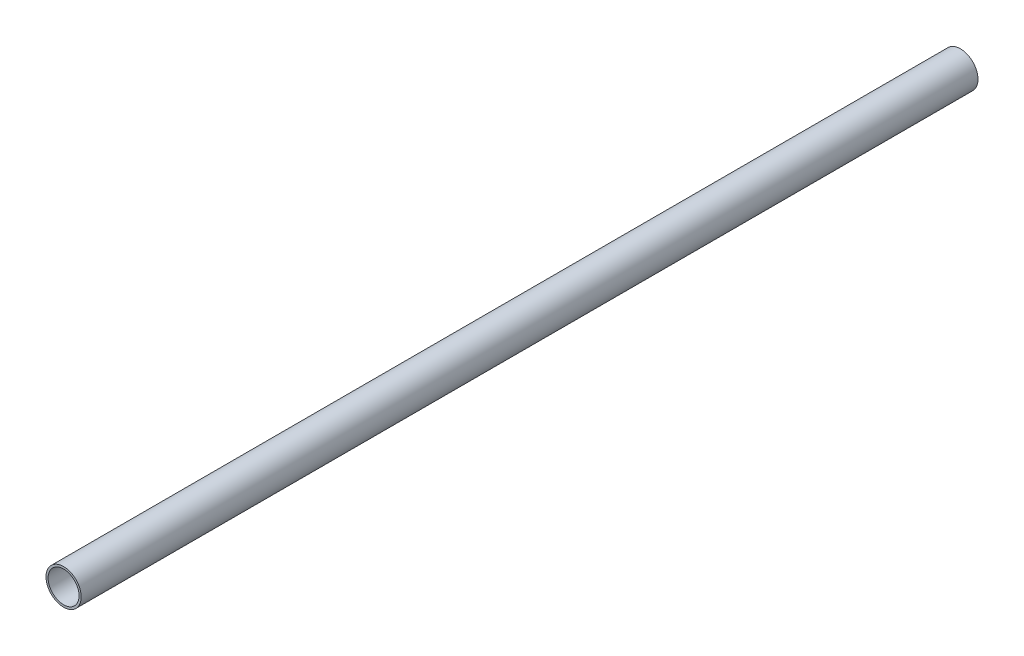
ISO-10303-21;
HEADER;
FILE_DESCRIPTION(('STEP AP214'),'2;1');
FILE_NAME('part.step','',(''),(''),'','','');
FILE_SCHEMA(('AUTOMOTIVE_DESIGN { 1 0 10303 214 1 1 1 1 }'));
ENDSEC;
DATA;
#1=APPLICATION_CONTEXT('core data for automotive mechanical design processes');
#2=APPLICATION_PROTOCOL_DEFINITION('international standard','automotive_design',2000,#1);
#3=PRODUCT_CONTEXT('',#1,'mechanical');
#4=PRODUCT('Part','Part','',(#3));
#5=PRODUCT_RELATED_PRODUCT_CATEGORY('part','',(#4));
#6=PRODUCT_DEFINITION_FORMATION('','',#4);
#7=PRODUCT_DEFINITION_CONTEXT('part definition',#1,'design');
#8=PRODUCT_DEFINITION('design','',#6,#7);
#9=PRODUCT_DEFINITION_SHAPE('','',#8);
#10=(LENGTH_UNIT() NAMED_UNIT(*) SI_UNIT(.MILLI.,.METRE.));
#11=(NAMED_UNIT(*) PLANE_ANGLE_UNIT() SI_UNIT($,.RADIAN.));
#12=(NAMED_UNIT(*) SI_UNIT($,.STERADIAN.) SOLID_ANGLE_UNIT());
#13=UNCERTAINTY_MEASURE_WITH_UNIT(LENGTH_MEASURE(1.E-05),#10,'distance_accuracy_value','');
#14=(GEOMETRIC_REPRESENTATION_CONTEXT(3) GLOBAL_UNCERTAINTY_ASSIGNED_CONTEXT((#13)) GLOBAL_UNIT_ASSIGNED_CONTEXT((#10,
#11,#12)) REPRESENTATION_CONTEXT('',''));
#15=CARTESIAN_POINT('',(0.,0.,0.));
#16=DIRECTION('',(0.,0.,1.));
#17=DIRECTION('',(1.,0.,0.));
#18=AXIS2_PLACEMENT_3D('',#15,#16,#17);
#19=CARTESIAN_POINT('',(4.21884749357559E-12,691.00000000001,-900.000000000006));
#20=DIRECTION('',(0.,0.,-1.));
#21=DIRECTION('',(0.,1.00000000000001,0.));
#22=AXIS2_PLACEMENT_3D('',#19,#20,#21);
#23=CYLINDRICAL_SURFACE('',#22,12.5);
#24=CARTESIAN_POINT('',(7.99360577730113E-12,691.000000000009,-1557.));
#25=DIRECTION('',(0.,0.,-1.));
#26=DIRECTION('',(0.,1.00000000000001,0.));
#27=AXIS2_PLACEMENT_3D('',#24,#25,#26);
#28=CIRCLE('',#27,12.5);
#29=CARTESIAN_POINT('',(8.0407902558477E-12,703.500000000009,-1557.));
#30=VERTEX_POINT('',#29);
#31=EDGE_CURVE('E57',#30,#30,#28,.T.);
#32=ORIENTED_EDGE('',*,*,#31,.F.);
#33=EDGE_LOOP('',(#32));
#34=FACE_BOUND('',#33,.T.);
#35=CARTESIAN_POINT('',(2.66453525910038E-12,691.000000000008,-920.000000000005));
#36=DIRECTION('',(0.,0.,1.));
#37=DIRECTION('',(0.,-1.00000000000001,0.));
#38=AXIS2_PLACEMENT_3D('',#35,#36,#37);
#39=CIRCLE('',#38,12.5);
#40=CARTESIAN_POINT('',(2.61735078055381E-12,678.500000000008,-920.000000000005));
#41=VERTEX_POINT('',#40);
#42=EDGE_CURVE('E43',#41,#41,#39,.T.);
#43=ORIENTED_EDGE('',*,*,#42,.F.);
#44=EDGE_LOOP('',(#43));
#45=FACE_BOUND('',#44,.T.);
#46=ADVANCED_FACE('F39',(#34,#45),#23,.T.);
#47=CARTESIAN_POINT('',(-15.4999999999961,3.27515792264421E-12,-1557.));
#48=DIRECTION('',(0.,0.,-1.));
#49=DIRECTION('',(0.,1.00000000000001,0.));
#50=AXIS2_PLACEMENT_3D('',#47,#48,#49);
#51=PLANE('',#50);
#52=CARTESIAN_POINT('',(7.99360577730113E-12,691.000000000009,-1557.));
#53=DIRECTION('',(0.,0.,-1.));
#54=DIRECTION('',(0.,1.00000000000001,0.));
#55=AXIS2_PLACEMENT_3D('',#52,#53,#54);
#56=CIRCLE('',#55,10.9999999999999);
#57=CARTESIAN_POINT('',(8.03512811842211E-12,702.000000000009,-1557.));
#58=VERTEX_POINT('',#57);
#59=EDGE_CURVE('E55',#58,#58,#56,.T.);
#60=ORIENTED_EDGE('',*,*,#59,.F.);
#61=EDGE_LOOP('',(#60));
#62=FACE_BOUND('',#61,.T.);
#63=ORIENTED_EDGE('',*,*,#31,.T.);
#64=EDGE_LOOP('',(#63));
#65=FACE_BOUND('',#64,.T.);
#66=ADVANCED_FACE('F71',(#62,#65),#51,.T.);
#67=CARTESIAN_POINT('',(-15.4999999999992,7.7715611723761E-13,-920.000000000001));
#68=DIRECTION('',(0.,0.,1.));
#69=DIRECTION('',(0.,-1.00000000000001,0.));
#70=AXIS2_PLACEMENT_3D('',#67,#68,#69);
#71=PLANE('',#70);
#72=CARTESIAN_POINT('',(2.66453525910038E-12,691.000000000008,-920.000000000005));
#73=DIRECTION('',(0.,0.,1.));
#74=DIRECTION('',(0.,-1.00000000000001,0.));
#75=AXIS2_PLACEMENT_3D('',#72,#73,#74);
#76=CIRCLE('',#75,10.9999999999999);
#77=CARTESIAN_POINT('',(2.62301291797939E-12,680.000000000008,-920.000000000005));
#78=VERTEX_POINT('',#77);
#79=EDGE_CURVE('E10',#78,#78,#76,.T.);
#80=ORIENTED_EDGE('',*,*,#79,.F.);
#81=EDGE_LOOP('',(#80));
#82=FACE_BOUND('',#81,.T.);
#83=ORIENTED_EDGE('',*,*,#42,.T.);
#84=EDGE_LOOP('',(#83));
#85=FACE_BOUND('',#84,.T.);
#86=ADVANCED_FACE('F73',(#82,#85),#71,.T.);
#87=CARTESIAN_POINT('',(4.21884749357559E-12,691.00000000001,-900.000000000006));
#88=DIRECTION('',(0.,0.,-1.));
#89=DIRECTION('',(0.,1.00000000000001,0.));
#90=AXIS2_PLACEMENT_3D('',#87,#88,#89);
#91=CYLINDRICAL_SURFACE('',#90,10.9999999999999);
#92=ORIENTED_EDGE('',*,*,#59,.T.);
#93=EDGE_LOOP('',(#92));
#94=FACE_BOUND('',#93,.T.);
#95=ORIENTED_EDGE('',*,*,#79,.T.);
#96=EDGE_LOOP('',(#95));
#97=FACE_BOUND('',#96,.T.);
#98=ADVANCED_FACE('F41',(#94,#97),#91,.F.);
#99=CLOSED_SHELL('',(#46,#66,#86,#98));
#100=MANIFOLD_SOLID_BREP('B2',#99);
#101=ADVANCED_BREP_SHAPE_REPRESENTATION('',(#18,#100),#14);
#102=SHAPE_DEFINITION_REPRESENTATION(#9,#101);
ENDSEC;
END-ISO-10303-21;
